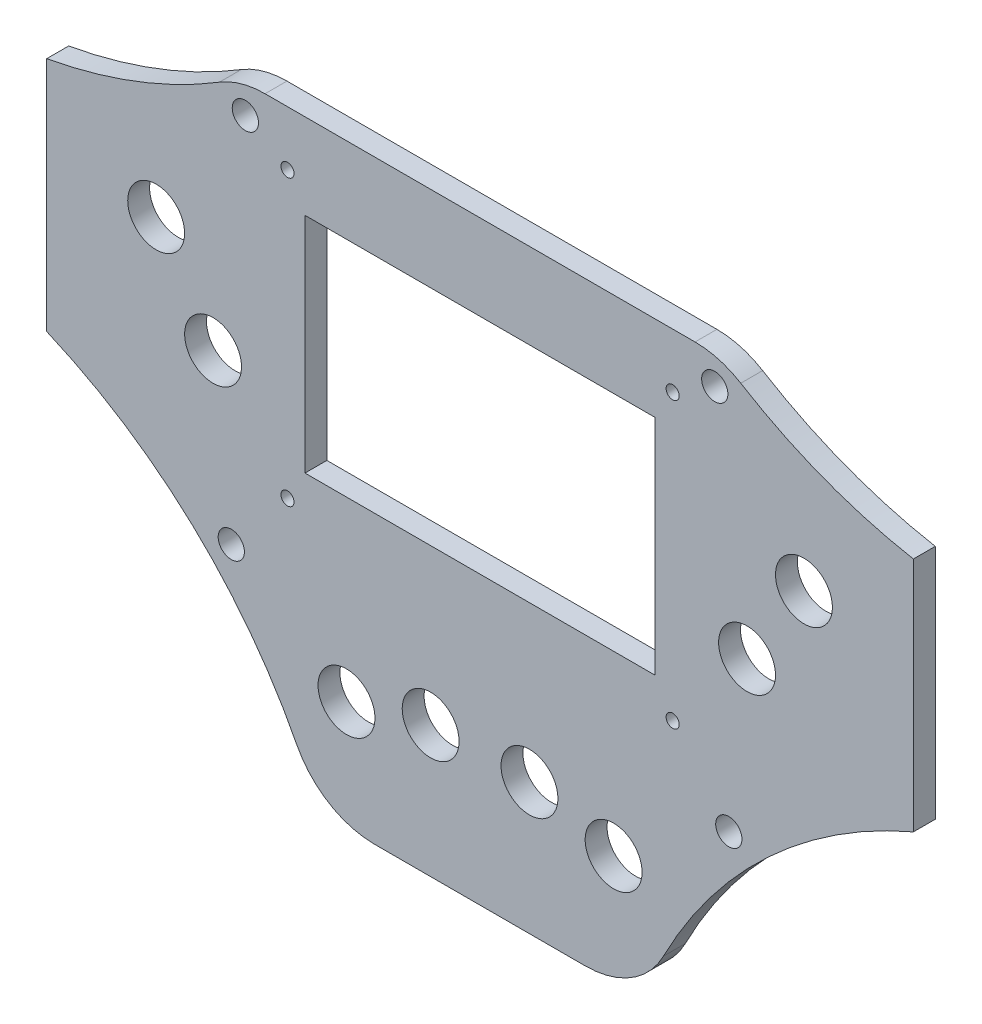
ISO-10303-21;
HEADER;
FILE_DESCRIPTION(('STEP AP214'),'2;1');
FILE_NAME('part.step','',(''),(''),'','','');
FILE_SCHEMA(('AUTOMOTIVE_DESIGN { 1 0 10303 214 1 1 1 1 }'));
ENDSEC;
DATA;
#1=APPLICATION_CONTEXT('core data for automotive mechanical design processes');
#2=APPLICATION_PROTOCOL_DEFINITION('international standard','automotive_design',2000,#1);
#3=PRODUCT_CONTEXT('',#1,'mechanical');
#4=PRODUCT('Part','Part','',(#3));
#5=PRODUCT_RELATED_PRODUCT_CATEGORY('part','',(#4));
#6=PRODUCT_DEFINITION_FORMATION('','',#4);
#7=PRODUCT_DEFINITION_CONTEXT('part definition',#1,'design');
#8=PRODUCT_DEFINITION('design','',#6,#7);
#9=PRODUCT_DEFINITION_SHAPE('','',#8);
#10=(LENGTH_UNIT() NAMED_UNIT(*) SI_UNIT(.MILLI.,.METRE.));
#11=(NAMED_UNIT(*) PLANE_ANGLE_UNIT() SI_UNIT($,.RADIAN.));
#12=(NAMED_UNIT(*) SI_UNIT($,.STERADIAN.) SOLID_ANGLE_UNIT());
#13=UNCERTAINTY_MEASURE_WITH_UNIT(LENGTH_MEASURE(1.E-05),#10,'distance_accuracy_value','');
#14=(GEOMETRIC_REPRESENTATION_CONTEXT(3) GLOBAL_UNCERTAINTY_ASSIGNED_CONTEXT((#13)) GLOBAL_UNIT_ASSIGNED_CONTEXT((#10,
#11,#12)) REPRESENTATION_CONTEXT('',''));
#15=CARTESIAN_POINT('',(0.,0.,0.));
#16=DIRECTION('',(0.,0.,1.));
#17=DIRECTION('',(1.,0.,0.));
#18=AXIS2_PLACEMENT_3D('',#15,#16,#17);
#19=CARTESIAN_POINT('',(119.602505223607,163.139457213261,5.));
#20=DIRECTION('',(0.,0.,-1.));
#21=DIRECTION('',(-1.,0.,0.));
#22=AXIS2_PLACEMENT_3D('',#19,#20,#21);
#23=PLANE('',#22);
#24=CARTESIAN_POINT('',(74.,31.1676261344596,5.));
#25=DIRECTION('',(0.,0.,1.));
#26=DIRECTION('',(1.,0.,0.));
#27=AXIS2_PLACEMENT_3D('',#24,#25,#26);
#28=CIRCLE('',#27,6.5);
#29=CARTESIAN_POINT('',(80.5,31.1676261344596,5.));
#30=VERTEX_POINT('',#29);
#31=EDGE_CURVE('E186',#30,#30,#28,.T.);
#32=ORIENTED_EDGE('',*,*,#31,.F.);
#33=EDGE_LOOP('',(#32));
#34=FACE_BOUND('',#33,.T.);
#35=CARTESIAN_POINT('',(119.602505223607,163.139457213261,5.));
#36=DIRECTION('',(0.,0.,-1.));
#37=DIRECTION('',(-1.,0.,0.));
#38=AXIS2_PLACEMENT_3D('',#35,#36,#37);
#39=CIRCLE('',#38,115.);
#40=CARTESIAN_POINT('',(99.,50.,5.));
#41=VERTEX_POINT('',#40);
#42=CARTESIAN_POINT('',(59.5611162901894,65.0576973649275,5.));
#43=VERTEX_POINT('',#42);
#44=EDGE_CURVE('E192',#41,#43,#39,.T.);
#45=ORIENTED_EDGE('',*,*,#44,.T.);
#46=CARTESIAN_POINT('',(49.1191356061168,48.,5.));
#47=DIRECTION('',(0.,0.,1.));
#48=DIRECTION('',(1.,0.,0.));
#49=AXIS2_PLACEMENT_3D('',#46,#47,#48);
#50=CIRCLE('',#49,20.);
#51=CARTESIAN_POINT('',(49.1191356061168,68.,5.));
#52=VERTEX_POINT('',#51);
#53=EDGE_CURVE('E195',#43,#52,#50,.T.);
#54=ORIENTED_EDGE('',*,*,#53,.T.);
#55=DIRECTION('',(-1.,0.,0.));
#56=VECTOR('',#55,1.);
#57=CARTESIAN_POINT('',(-49.1191356061168,68.,5.));
#58=LINE('',#57,#56);
#59=CARTESIAN_POINT('',(-49.1191356061168,68.,5.));
#60=VERTEX_POINT('',#59);
#61=EDGE_CURVE('E198',#52,#60,#58,.T.);
#62=ORIENTED_EDGE('',*,*,#61,.T.);
#63=CARTESIAN_POINT('',(-49.1191356061168,48.,5.));
#64=DIRECTION('',(0.,0.,1.));
#65=DIRECTION('',(-1.,0.,0.));
#66=AXIS2_PLACEMENT_3D('',#63,#64,#65);
#67=CIRCLE('',#66,20.);
#68=CARTESIAN_POINT('',(-59.5611162901894,65.0576973649275,5.));
#69=VERTEX_POINT('',#68);
#70=EDGE_CURVE('E200',#60,#69,#67,.T.);
#71=ORIENTED_EDGE('',*,*,#70,.T.);
#72=CARTESIAN_POINT('',(-119.602505223607,163.139457213261,5.));
#73=DIRECTION('',(0.,0.,-1.));
#74=DIRECTION('',(1.,0.,0.));
#75=AXIS2_PLACEMENT_3D('',#72,#73,#74);
#76=CIRCLE('',#75,115.);
#77=CARTESIAN_POINT('',(-99.,50.,5.));
#78=VERTEX_POINT('',#77);
#79=EDGE_CURVE('E202',#69,#78,#76,.T.);
#80=ORIENTED_EDGE('',*,*,#79,.T.);
#81=DIRECTION('',(0.,-1.,0.));
#82=VECTOR('',#81,1.);
#83=CARTESIAN_POINT('',(-99.,-3.99999999999998,5.));
#84=LINE('',#83,#82);
#85=CARTESIAN_POINT('',(-99.0000000000001,-4.,5.));
#86=VERTEX_POINT('',#85);
#87=EDGE_CURVE('E204',#78,#86,#84,.T.);
#88=ORIENTED_EDGE('',*,*,#87,.T.);
#89=CARTESIAN_POINT('',(-144.147014112087,-109.767419921084,5.));
#90=DIRECTION('',(0.,0.,-1.));
#91=DIRECTION('',(1.,0.,0.));
#92=AXIS2_PLACEMENT_3D('',#89,#90,#91);
#93=CIRCLE('',#92,115.);
#94=CARTESIAN_POINT('',(-41.8900641106708,-57.1507288771977,5.));
#95=VERTEX_POINT('',#94);
#96=EDGE_CURVE('E206',#86,#95,#93,.T.);
#97=ORIENTED_EDGE('',*,*,#96,.T.);
#98=CARTESIAN_POINT('',(-24.1062467191201,-48.,5.));
#99=DIRECTION('',(0.,0.,1.));
#100=DIRECTION('',(-1.,0.,0.));
#101=AXIS2_PLACEMENT_3D('',#98,#99,#100);
#102=CIRCLE('',#101,20.);
#103=CARTESIAN_POINT('',(-24.1062467191201,-68.,5.));
#104=VERTEX_POINT('',#103);
#105=EDGE_CURVE('E208',#95,#104,#102,.T.);
#106=ORIENTED_EDGE('',*,*,#105,.T.);
#107=DIRECTION('',(1.,0.,0.));
#108=VECTOR('',#107,1.);
#109=CARTESIAN_POINT('',(-24.1062467191201,-68.,5.));
#110=LINE('',#109,#108);
#111=CARTESIAN_POINT('',(24.1062467191201,-68.,5.));
#112=VERTEX_POINT('',#111);
#113=EDGE_CURVE('E210',#104,#112,#110,.T.);
#114=ORIENTED_EDGE('',*,*,#113,.T.);
#115=CARTESIAN_POINT('',(24.1062467191201,-48.,5.));
#116=DIRECTION('',(0.,0.,1.));
#117=DIRECTION('',(1.,0.,0.));
#118=AXIS2_PLACEMENT_3D('',#115,#116,#117);
#119=CIRCLE('',#118,20.);
#120=CARTESIAN_POINT('',(41.8900641106707,-57.1507288771977,5.));
#121=VERTEX_POINT('',#120);
#122=EDGE_CURVE('E212',#112,#121,#119,.T.);
#123=ORIENTED_EDGE('',*,*,#122,.T.);
#124=CARTESIAN_POINT('',(144.147014112087,-109.767419921084,5.));
#125=DIRECTION('',(0.,0.,-1.));
#126=DIRECTION('',(-1.,0.,0.));
#127=AXIS2_PLACEMENT_3D('',#124,#125,#126);
#128=CIRCLE('',#127,115.);
#129=CARTESIAN_POINT('',(99.,-3.99999999999998,5.));
#130=VERTEX_POINT('',#129);
#131=EDGE_CURVE('E214',#121,#130,#128,.T.);
#132=ORIENTED_EDGE('',*,*,#131,.T.);
#133=DIRECTION('',(0.,1.,0.));
#134=VECTOR('',#133,1.);
#135=CARTESIAN_POINT('',(99.,-3.99999999999998,5.));
#136=LINE('',#135,#134);
#137=EDGE_CURVE('E216',#130,#41,#136,.T.);
#138=ORIENTED_EDGE('',*,*,#137,.T.);
#139=EDGE_LOOP('',(#45,#54,#62,#71,#80,#88,#97,#106,#114,#123,#132,#138));
#140=FACE_BOUND('',#139,.T.);
#141=DIRECTION('',(0.,-1.,0.));
#142=VECTOR('',#141,1.);
#143=CARTESIAN_POINT('',(-40.,-2.49999999999999,5.));
#144=LINE('',#143,#142);
#145=CARTESIAN_POINT('',(-40.,48.5,5.));
#146=VERTEX_POINT('',#145);
#147=CARTESIAN_POINT('',(-40.,-2.49999999999999,5.));
#148=VERTEX_POINT('',#147);
#149=EDGE_CURVE('E147',#146,#148,#144,.T.);
#150=ORIENTED_EDGE('',*,*,#149,.F.);
#151=DIRECTION('',(-1.,0.,0.));
#152=VECTOR('',#151,1.);
#153=CARTESIAN_POINT('',(-40.,48.5,5.));
#154=LINE('',#153,#152);
#155=CARTESIAN_POINT('',(40.,48.5,5.));
#156=VERTEX_POINT('',#155);
#157=EDGE_CURVE('E170',#156,#146,#154,.T.);
#158=ORIENTED_EDGE('',*,*,#157,.F.);
#159=DIRECTION('',(0.,1.,0.));
#160=VECTOR('',#159,1.);
#161=CARTESIAN_POINT('',(40.,-2.49999999999999,5.));
#162=LINE('',#161,#160);
#163=CARTESIAN_POINT('',(40.,-2.49999999999999,5.));
#164=VERTEX_POINT('',#163);
#165=EDGE_CURVE('E168',#164,#156,#162,.T.);
#166=ORIENTED_EDGE('',*,*,#165,.F.);
#167=DIRECTION('',(1.,0.,0.));
#168=VECTOR('',#167,1.);
#169=CARTESIAN_POINT('',(-40.,-2.49999999999999,5.));
#170=LINE('',#169,#168);
#171=EDGE_CURVE('E155',#148,#164,#170,.T.);
#172=ORIENTED_EDGE('',*,*,#171,.F.);
#173=EDGE_LOOP('',(#150,#158,#166,#172));
#174=FACE_BOUND('',#173,.T.);
#175=CARTESIAN_POINT('',(11.289140567969,-38.,5.));
#176=DIRECTION('',(0.,0.,1.));
#177=DIRECTION('',(1.,0.,0.));
#178=AXIS2_PLACEMENT_3D('',#175,#176,#177);
#179=CIRCLE('',#178,6.5);
#180=CARTESIAN_POINT('',(17.7891405679689,-38.,5.));
#181=VERTEX_POINT('',#180);
#182=EDGE_CURVE('E176',#181,#181,#179,.T.);
#183=ORIENTED_EDGE('',*,*,#182,.F.);
#184=EDGE_LOOP('',(#183));
#185=FACE_BOUND('',#184,.T.);
#186=CARTESIAN_POINT('',(30.5141585693794,-43.,5.));
#187=DIRECTION('',(0.,0.,1.));
#188=DIRECTION('',(1.,0.,0.));
#189=AXIS2_PLACEMENT_3D('',#186,#187,#188);
#190=CIRCLE('',#189,6.5);
#191=CARTESIAN_POINT('',(37.0141585693794,-43.,5.));
#192=VERTEX_POINT('',#191);
#193=EDGE_CURVE('E724',#192,#192,#190,.T.);
#194=ORIENTED_EDGE('',*,*,#193,.F.);
#195=EDGE_LOOP('',(#194));
#196=FACE_BOUND('',#195,.T.);
#197=CARTESIAN_POINT('',(61.,11.2610411169396,5.));
#198=DIRECTION('',(0.,0.,1.));
#199=DIRECTION('',(1.,0.,0.));
#200=AXIS2_PLACEMENT_3D('',#197,#198,#199);
#201=CIRCLE('',#200,6.50000000000002);
#202=CARTESIAN_POINT('',(67.5,11.2610411169396,5.));
#203=VERTEX_POINT('',#202);
#204=EDGE_CURVE('E718',#203,#203,#201,.T.);
#205=ORIENTED_EDGE('',*,*,#204,.F.);
#206=EDGE_LOOP('',(#205));
#207=FACE_BOUND('',#206,.T.);
#208=CARTESIAN_POINT('',(-53.6243016500244,61.4463557748613,5.));
#209=DIRECTION('',(0.,0.,1.));
#210=DIRECTION('',(-1.,0.,0.));
#211=AXIS2_PLACEMENT_3D('',#208,#209,#210);
#212=CIRCLE('',#211,3.);
#213=CARTESIAN_POINT('',(-56.6243016500244,61.4463557748613,5.));
#214=VERTEX_POINT('',#213);
#215=EDGE_CURVE('E712',#214,#214,#212,.T.);
#216=ORIENTED_EDGE('',*,*,#215,.F.);
#217=EDGE_LOOP('',(#216));
#218=FACE_BOUND('',#217,.T.);
#219=CARTESIAN_POINT('',(-56.8349136115492,-25.0288417973948,5.));
#220=DIRECTION('',(0.,0.,1.));
#221=DIRECTION('',(-1.,0.,0.));
#222=AXIS2_PLACEMENT_3D('',#219,#220,#221);
#223=CIRCLE('',#222,3.);
#224=CARTESIAN_POINT('',(-59.8349136115492,-25.0288417973948,5.));
#225=VERTEX_POINT('',#224);
#226=EDGE_CURVE('E706',#225,#225,#223,.T.);
#227=ORIENTED_EDGE('',*,*,#226,.F.);
#228=EDGE_LOOP('',(#227));
#229=FACE_BOUND('',#228,.T.);
#230=CARTESIAN_POINT('',(56.8349136115492,-25.0288417973948,5.));
#231=DIRECTION('',(0.,0.,1.));
#232=DIRECTION('',(1.,0.,0.));
#233=AXIS2_PLACEMENT_3D('',#230,#231,#232);
#234=CIRCLE('',#233,3.);
#235=CARTESIAN_POINT('',(59.8349136115492,-25.0288417973948,5.));
#236=VERTEX_POINT('',#235);
#237=EDGE_CURVE('E700',#236,#236,#234,.T.);
#238=ORIENTED_EDGE('',*,*,#237,.F.);
#239=EDGE_LOOP('',(#238));
#240=FACE_BOUND('',#239,.T.);
#241=CARTESIAN_POINT('',(-44.,55.5,5.));
#242=DIRECTION('',(0.,0.,1.));
#243=DIRECTION('',(-1.,0.,0.));
#244=AXIS2_PLACEMENT_3D('',#241,#242,#243);
#245=CIRCLE('',#244,1.5);
#246=CARTESIAN_POINT('',(-45.5,55.5,5.));
#247=VERTEX_POINT('',#246);
#248=EDGE_CURVE('E694',#247,#247,#245,.T.);
#249=ORIENTED_EDGE('',*,*,#248,.F.);
#250=EDGE_LOOP('',(#249));
#251=FACE_BOUND('',#250,.T.);
#252=CARTESIAN_POINT('',(-44.,-9.49999999999997,5.));
#253=DIRECTION('',(0.,0.,1.));
#254=DIRECTION('',(-1.,0.,0.));
#255=AXIS2_PLACEMENT_3D('',#252,#253,#254);
#256=CIRCLE('',#255,1.5);
#257=CARTESIAN_POINT('',(-45.5,-9.49999999999997,5.));
#258=VERTEX_POINT('',#257);
#259=EDGE_CURVE('E688',#258,#258,#256,.T.);
#260=ORIENTED_EDGE('',*,*,#259,.F.);
#261=EDGE_LOOP('',(#260));
#262=FACE_BOUND('',#261,.T.);
#263=CARTESIAN_POINT('',(44.,-9.49999999999997,5.));
#264=DIRECTION('',(0.,0.,1.));
#265=DIRECTION('',(1.,0.,0.));
#266=AXIS2_PLACEMENT_3D('',#263,#264,#265);
#267=CIRCLE('',#266,1.5);
#268=CARTESIAN_POINT('',(45.5,-9.49999999999997,5.));
#269=VERTEX_POINT('',#268);
#270=EDGE_CURVE('E682',#269,#269,#267,.T.);
#271=ORIENTED_EDGE('',*,*,#270,.F.);
#272=EDGE_LOOP('',(#271));
#273=FACE_BOUND('',#272,.T.);
#274=CARTESIAN_POINT('',(44.,55.5,5.));
#275=DIRECTION('',(0.,0.,1.));
#276=DIRECTION('',(1.,0.,0.));
#277=AXIS2_PLACEMENT_3D('',#274,#275,#276);
#278=CIRCLE('',#277,1.5);
#279=CARTESIAN_POINT('',(45.5,55.5,5.));
#280=VERTEX_POINT('',#279);
#281=EDGE_CURVE('E676',#280,#280,#278,.T.);
#282=ORIENTED_EDGE('',*,*,#281,.F.);
#283=EDGE_LOOP('',(#282));
#284=FACE_BOUND('',#283,.T.);
#285=CARTESIAN_POINT('',(-30.5141585693794,-43.,5.));
#286=DIRECTION('',(0.,0.,1.));
#287=DIRECTION('',(-1.,0.,0.));
#288=AXIS2_PLACEMENT_3D('',#285,#286,#287);
#289=CIRCLE('',#288,6.5);
#290=CARTESIAN_POINT('',(-37.0141585693794,-43.,5.));
#291=VERTEX_POINT('',#290);
#292=EDGE_CURVE('E670',#291,#291,#289,.T.);
#293=ORIENTED_EDGE('',*,*,#292,.F.);
#294=EDGE_LOOP('',(#293));
#295=FACE_BOUND('',#294,.T.);
#296=CARTESIAN_POINT('',(-11.289140567969,-38.,5.));
#297=DIRECTION('',(0.,0.,1.));
#298=DIRECTION('',(-1.,0.,0.));
#299=AXIS2_PLACEMENT_3D('',#296,#297,#298);
#300=CIRCLE('',#299,6.5);
#301=CARTESIAN_POINT('',(-17.789140567969,-38.,5.));
#302=VERTEX_POINT('',#301);
#303=EDGE_CURVE('E664',#302,#302,#300,.T.);
#304=ORIENTED_EDGE('',*,*,#303,.F.);
#305=EDGE_LOOP('',(#304));
#306=FACE_BOUND('',#305,.T.);
#307=CARTESIAN_POINT('',(-61.,11.2610411169396,5.));
#308=DIRECTION('',(0.,0.,1.));
#309=DIRECTION('',(-1.,0.,0.));
#310=AXIS2_PLACEMENT_3D('',#307,#308,#309);
#311=CIRCLE('',#310,6.50000000000002);
#312=CARTESIAN_POINT('',(-67.5,11.2610411169396,5.));
#313=VERTEX_POINT('',#312);
#314=EDGE_CURVE('E658',#313,#313,#311,.T.);
#315=ORIENTED_EDGE('',*,*,#314,.F.);
#316=EDGE_LOOP('',(#315));
#317=FACE_BOUND('',#316,.T.);
#318=CARTESIAN_POINT('',(-74.,31.1676261344596,5.));
#319=DIRECTION('',(0.,0.,1.));
#320=DIRECTION('',(-1.,0.,0.));
#321=AXIS2_PLACEMENT_3D('',#318,#319,#320);
#322=CIRCLE('',#321,6.5);
#323=CARTESIAN_POINT('',(-80.5,31.1676261344596,5.));
#324=VERTEX_POINT('',#323);
#325=EDGE_CURVE('E652',#324,#324,#322,.T.);
#326=ORIENTED_EDGE('',*,*,#325,.F.);
#327=EDGE_LOOP('',(#326));
#328=FACE_BOUND('',#327,.T.);
#329=CARTESIAN_POINT('',(53.6243016500244,61.4463557748613,5.));
#330=DIRECTION('',(0.,0.,1.));
#331=DIRECTION('',(1.,0.,0.));
#332=AXIS2_PLACEMENT_3D('',#329,#330,#331);
#333=CIRCLE('',#332,3.);
#334=CARTESIAN_POINT('',(56.6243016500244,61.4463557748613,5.));
#335=VERTEX_POINT('',#334);
#336=EDGE_CURVE('E643',#335,#335,#333,.T.);
#337=ORIENTED_EDGE('',*,*,#336,.F.);
#338=EDGE_LOOP('',(#337));
#339=FACE_BOUND('',#338,.T.);
#340=ADVANCED_FACE('F34',(#34,#140,#174,#185,#196,#207,#218,#229,#240,#251,#262,#273,#284,#295,
#306,#317,#328,#339),#23,.F.);
#341=CARTESIAN_POINT('',(119.602505223607,163.139457213261,0.));
#342=DIRECTION('',(0.,0.,-1.));
#343=DIRECTION('',(-1.,0.,0.));
#344=AXIS2_PLACEMENT_3D('',#341,#342,#343);
#345=PLANE('',#344);
#346=CARTESIAN_POINT('',(-74.,31.1676261344596,0.));
#347=DIRECTION('',(0.,0.,1.));
#348=DIRECTION('',(-1.,0.,0.));
#349=AXIS2_PLACEMENT_3D('',#346,#347,#348);
#350=CIRCLE('',#349,6.5);
#351=CARTESIAN_POINT('',(-80.5,31.1676261344596,0.));
#352=VERTEX_POINT('',#351);
#353=EDGE_CURVE('E649',#352,#352,#350,.T.);
#354=ORIENTED_EDGE('',*,*,#353,.T.);
#355=EDGE_LOOP('',(#354));
#356=FACE_BOUND('',#355,.T.);
#357=CARTESIAN_POINT('',(-11.289140567969,-38.,0.));
#358=DIRECTION('',(0.,0.,1.));
#359=DIRECTION('',(-1.,0.,0.));
#360=AXIS2_PLACEMENT_3D('',#357,#358,#359);
#361=CIRCLE('',#360,6.5);
#362=CARTESIAN_POINT('',(-17.789140567969,-38.,0.));
#363=VERTEX_POINT('',#362);
#364=EDGE_CURVE('E661',#363,#363,#361,.T.);
#365=ORIENTED_EDGE('',*,*,#364,.T.);
#366=EDGE_LOOP('',(#365));
#367=FACE_BOUND('',#366,.T.);
#368=CARTESIAN_POINT('',(44.,55.5,0.));
#369=DIRECTION('',(0.,0.,1.));
#370=DIRECTION('',(1.,0.,0.));
#371=AXIS2_PLACEMENT_3D('',#368,#369,#370);
#372=CIRCLE('',#371,1.5);
#373=CARTESIAN_POINT('',(45.5,55.5,0.));
#374=VERTEX_POINT('',#373);
#375=EDGE_CURVE('E673',#374,#374,#372,.T.);
#376=ORIENTED_EDGE('',*,*,#375,.T.);
#377=EDGE_LOOP('',(#376));
#378=FACE_BOUND('',#377,.T.);
#379=CARTESIAN_POINT('',(-44.,-9.49999999999997,0.));
#380=DIRECTION('',(0.,0.,1.));
#381=DIRECTION('',(-1.,0.,0.));
#382=AXIS2_PLACEMENT_3D('',#379,#380,#381);
#383=CIRCLE('',#382,1.5);
#384=CARTESIAN_POINT('',(-45.5,-9.49999999999997,0.));
#385=VERTEX_POINT('',#384);
#386=EDGE_CURVE('E685',#385,#385,#383,.T.);
#387=ORIENTED_EDGE('',*,*,#386,.T.);
#388=EDGE_LOOP('',(#387));
#389=FACE_BOUND('',#388,.T.);
#390=CARTESIAN_POINT('',(56.8349136115492,-25.0288417973948,0.));
#391=DIRECTION('',(0.,0.,1.));
#392=DIRECTION('',(1.,0.,0.));
#393=AXIS2_PLACEMENT_3D('',#390,#391,#392);
#394=CIRCLE('',#393,3.);
#395=CARTESIAN_POINT('',(59.8349136115492,-25.0288417973948,0.));
#396=VERTEX_POINT('',#395);
#397=EDGE_CURVE('E697',#396,#396,#394,.T.);
#398=ORIENTED_EDGE('',*,*,#397,.T.);
#399=EDGE_LOOP('',(#398));
#400=FACE_BOUND('',#399,.T.);
#401=CARTESIAN_POINT('',(-53.6243016500244,61.4463557748613,0.));
#402=DIRECTION('',(0.,0.,1.));
#403=DIRECTION('',(-1.,0.,0.));
#404=AXIS2_PLACEMENT_3D('',#401,#402,#403);
#405=CIRCLE('',#404,3.);
#406=CARTESIAN_POINT('',(-56.6243016500244,61.4463557748613,0.));
#407=VERTEX_POINT('',#406);
#408=EDGE_CURVE('E709',#407,#407,#405,.T.);
#409=ORIENTED_EDGE('',*,*,#408,.T.);
#410=EDGE_LOOP('',(#409));
#411=FACE_BOUND('',#410,.T.);
#412=CARTESIAN_POINT('',(30.5141585693794,-43.,0.));
#413=DIRECTION('',(0.,0.,1.));
#414=DIRECTION('',(1.,0.,0.));
#415=AXIS2_PLACEMENT_3D('',#412,#413,#414);
#416=CIRCLE('',#415,6.5);
#417=CARTESIAN_POINT('',(37.0141585693794,-43.,0.));
#418=VERTEX_POINT('',#417);
#419=EDGE_CURVE('E721',#418,#418,#416,.T.);
#420=ORIENTED_EDGE('',*,*,#419,.T.);
#421=EDGE_LOOP('',(#420));
#422=FACE_BOUND('',#421,.T.);
#423=DIRECTION('',(-1.,0.,0.));
#424=VECTOR('',#423,1.);
#425=CARTESIAN_POINT('',(-40.,48.5,0.));
#426=LINE('',#425,#424);
#427=CARTESIAN_POINT('',(40.,48.5,0.));
#428=VERTEX_POINT('',#427);
#429=CARTESIAN_POINT('',(-40.,48.5,0.));
#430=VERTEX_POINT('',#429);
#431=EDGE_CURVE('E156',#428,#430,#426,.T.);
#432=ORIENTED_EDGE('',*,*,#431,.T.);
#433=DIRECTION('',(0.,-1.,0.));
#434=VECTOR('',#433,1.);
#435=CARTESIAN_POINT('',(-40.,-2.49999999999999,0.));
#436=LINE('',#435,#434);
#437=CARTESIAN_POINT('',(-40.,-2.49999999999999,0.));
#438=VERTEX_POINT('',#437);
#439=EDGE_CURVE('E57',#430,#438,#436,.T.);
#440=ORIENTED_EDGE('',*,*,#439,.T.);
#441=DIRECTION('',(1.,0.,0.));
#442=VECTOR('',#441,1.);
#443=CARTESIAN_POINT('',(-40.,-2.49999999999999,0.));
#444=LINE('',#443,#442);
#445=CARTESIAN_POINT('',(40.,-2.49999999999999,0.));
#446=VERTEX_POINT('',#445);
#447=EDGE_CURVE('E162',#438,#446,#444,.T.);
#448=ORIENTED_EDGE('',*,*,#447,.T.);
#449=DIRECTION('',(0.,1.,0.));
#450=VECTOR('',#449,1.);
#451=CARTESIAN_POINT('',(40.,-2.49999999999999,0.));
#452=LINE('',#451,#450);
#453=EDGE_CURVE('E178',#446,#428,#452,.T.);
#454=ORIENTED_EDGE('',*,*,#453,.T.);
#455=EDGE_LOOP('',(#432,#440,#448,#454));
#456=FACE_BOUND('',#455,.T.);
#457=CARTESIAN_POINT('',(74.,31.1676261344596,0.));
#458=DIRECTION('',(0.,0.,1.));
#459=DIRECTION('',(1.,0.,0.));
#460=AXIS2_PLACEMENT_3D('',#457,#458,#459);
#461=CIRCLE('',#460,6.5);
#462=CARTESIAN_POINT('',(80.5,31.1676261344596,0.));
#463=VERTEX_POINT('',#462);
#464=EDGE_CURVE('E163',#463,#463,#461,.T.);
#465=ORIENTED_EDGE('',*,*,#464,.T.);
#466=EDGE_LOOP('',(#465));
#467=FACE_BOUND('',#466,.T.);
#468=CARTESIAN_POINT('',(119.602505223607,163.139457213261,0.));
#469=DIRECTION('',(0.,0.,-1.));
#470=DIRECTION('',(-1.,0.,0.));
#471=AXIS2_PLACEMENT_3D('',#468,#469,#470);
#472=CIRCLE('',#471,115.);
#473=CARTESIAN_POINT('',(99.,50.,0.));
#474=VERTEX_POINT('',#473);
#475=CARTESIAN_POINT('',(59.5611162901894,65.0576973649275,0.));
#476=VERTEX_POINT('',#475);
#477=EDGE_CURVE('E189',#474,#476,#472,.T.);
#478=ORIENTED_EDGE('',*,*,#477,.F.);
#479=DIRECTION('',(0.,1.,0.));
#480=VECTOR('',#479,1.);
#481=CARTESIAN_POINT('',(99.,-3.99999999999998,0.));
#482=LINE('',#481,#480);
#483=CARTESIAN_POINT('',(99.,-3.99999999999998,0.));
#484=VERTEX_POINT('',#483);
#485=EDGE_CURVE('E196',#484,#474,#482,.T.);
#486=ORIENTED_EDGE('',*,*,#485,.F.);
#487=CARTESIAN_POINT('',(144.147014112087,-109.767419921084,0.));
#488=DIRECTION('',(0.,0.,-1.));
#489=DIRECTION('',(-1.,0.,0.));
#490=AXIS2_PLACEMENT_3D('',#487,#488,#489);
#491=CIRCLE('',#490,115.);
#492=CARTESIAN_POINT('',(41.8900641106707,-57.1507288771977,0.));
#493=VERTEX_POINT('',#492);
#494=EDGE_CURVE('E239',#493,#484,#491,.T.);
#495=ORIENTED_EDGE('',*,*,#494,.F.);
#496=CARTESIAN_POINT('',(24.1062467191201,-48.,0.));
#497=DIRECTION('',(0.,0.,1.));
#498=DIRECTION('',(1.,0.,0.));
#499=AXIS2_PLACEMENT_3D('',#496,#497,#498);
#500=CIRCLE('',#499,20.);
#501=CARTESIAN_POINT('',(24.1062467191201,-68.,0.));
#502=VERTEX_POINT('',#501);
#503=EDGE_CURVE('E237',#502,#493,#500,.T.);
#504=ORIENTED_EDGE('',*,*,#503,.F.);
#505=DIRECTION('',(1.,0.,0.));
#506=VECTOR('',#505,1.);
#507=CARTESIAN_POINT('',(-24.1062467191201,-68.,0.));
#508=LINE('',#507,#506);
#509=CARTESIAN_POINT('',(-24.1062467191201,-68.,0.));
#510=VERTEX_POINT('',#509);
#511=EDGE_CURVE('E235',#510,#502,#508,.T.);
#512=ORIENTED_EDGE('',*,*,#511,.F.);
#513=CARTESIAN_POINT('',(-24.1062467191201,-48.,0.));
#514=DIRECTION('',(0.,0.,1.));
#515=DIRECTION('',(-1.,0.,0.));
#516=AXIS2_PLACEMENT_3D('',#513,#514,#515);
#517=CIRCLE('',#516,20.);
#518=CARTESIAN_POINT('',(-41.8900641106708,-57.1507288771977,0.));
#519=VERTEX_POINT('',#518);
#520=EDGE_CURVE('E233',#519,#510,#517,.T.);
#521=ORIENTED_EDGE('',*,*,#520,.F.);
#522=CARTESIAN_POINT('',(-144.147014112087,-109.767419921084,0.));
#523=DIRECTION('',(0.,0.,-1.));
#524=DIRECTION('',(1.,0.,0.));
#525=AXIS2_PLACEMENT_3D('',#522,#523,#524);
#526=CIRCLE('',#525,115.);
#527=CARTESIAN_POINT('',(-99.0000000000001,-4.,0.));
#528=VERTEX_POINT('',#527);
#529=EDGE_CURVE('E231',#528,#519,#526,.T.);
#530=ORIENTED_EDGE('',*,*,#529,.F.);
#531=DIRECTION('',(0.,-1.,0.));
#532=VECTOR('',#531,1.);
#533=CARTESIAN_POINT('',(-99.,-3.99999999999998,0.));
#534=LINE('',#533,#532);
#535=CARTESIAN_POINT('',(-99.,50.,0.));
#536=VERTEX_POINT('',#535);
#537=EDGE_CURVE('E229',#536,#528,#534,.T.);
#538=ORIENTED_EDGE('',*,*,#537,.F.);
#539=CARTESIAN_POINT('',(-119.602505223607,163.139457213261,0.));
#540=DIRECTION('',(0.,0.,-1.));
#541=DIRECTION('',(1.,0.,0.));
#542=AXIS2_PLACEMENT_3D('',#539,#540,#541);
#543=CIRCLE('',#542,115.);
#544=CARTESIAN_POINT('',(-59.5611162901894,65.0576973649275,0.));
#545=VERTEX_POINT('',#544);
#546=EDGE_CURVE('E227',#545,#536,#543,.T.);
#547=ORIENTED_EDGE('',*,*,#546,.F.);
#548=CARTESIAN_POINT('',(-49.1191356061168,48.,0.));
#549=DIRECTION('',(0.,0.,1.));
#550=DIRECTION('',(-1.,0.,0.));
#551=AXIS2_PLACEMENT_3D('',#548,#549,#550);
#552=CIRCLE('',#551,20.);
#553=CARTESIAN_POINT('',(-49.1191356061168,68.,0.));
#554=VERTEX_POINT('',#553);
#555=EDGE_CURVE('E225',#554,#545,#552,.T.);
#556=ORIENTED_EDGE('',*,*,#555,.F.);
#557=DIRECTION('',(-1.,0.,0.));
#558=VECTOR('',#557,1.);
#559=CARTESIAN_POINT('',(-49.1191356061168,68.,0.));
#560=LINE('',#559,#558);
#561=CARTESIAN_POINT('',(49.1191356061168,68.,0.));
#562=VERTEX_POINT('',#561);
#563=EDGE_CURVE('E223',#562,#554,#560,.T.);
#564=ORIENTED_EDGE('',*,*,#563,.F.);
#565=CARTESIAN_POINT('',(49.1191356061168,48.,0.));
#566=DIRECTION('',(0.,0.,1.));
#567=DIRECTION('',(1.,0.,0.));
#568=AXIS2_PLACEMENT_3D('',#565,#566,#567);
#569=CIRCLE('',#568,20.);
#570=EDGE_CURVE('E221',#476,#562,#569,.T.);
#571=ORIENTED_EDGE('',*,*,#570,.F.);
#572=EDGE_LOOP('',(#478,#486,#495,#504,#512,#521,#530,#538,#547,#556,#564,#571));
#573=FACE_BOUND('',#572,.T.);
#574=CARTESIAN_POINT('',(11.289140567969,-38.,0.));
#575=DIRECTION('',(0.,0.,1.));
#576=DIRECTION('',(1.,0.,0.));
#577=AXIS2_PLACEMENT_3D('',#574,#575,#576);
#578=CIRCLE('',#577,6.5);
#579=CARTESIAN_POINT('',(17.7891405679689,-38.,0.));
#580=VERTEX_POINT('',#579);
#581=EDGE_CURVE('E727',#580,#580,#578,.T.);
#582=ORIENTED_EDGE('',*,*,#581,.T.);
#583=EDGE_LOOP('',(#582));
#584=FACE_BOUND('',#583,.T.);
#585=CARTESIAN_POINT('',(61.,11.2610411169396,0.));
#586=DIRECTION('',(0.,0.,1.));
#587=DIRECTION('',(1.,0.,0.));
#588=AXIS2_PLACEMENT_3D('',#585,#586,#587);
#589=CIRCLE('',#588,6.50000000000002);
#590=CARTESIAN_POINT('',(67.5,11.2610411169396,0.));
#591=VERTEX_POINT('',#590);
#592=EDGE_CURVE('E715',#591,#591,#589,.T.);
#593=ORIENTED_EDGE('',*,*,#592,.T.);
#594=EDGE_LOOP('',(#593));
#595=FACE_BOUND('',#594,.T.);
#596=CARTESIAN_POINT('',(-56.8349136115492,-25.0288417973948,0.));
#597=DIRECTION('',(0.,0.,1.));
#598=DIRECTION('',(-1.,0.,0.));
#599=AXIS2_PLACEMENT_3D('',#596,#597,#598);
#600=CIRCLE('',#599,3.);
#601=CARTESIAN_POINT('',(-59.8349136115492,-25.0288417973948,0.));
#602=VERTEX_POINT('',#601);
#603=EDGE_CURVE('E703',#602,#602,#600,.T.);
#604=ORIENTED_EDGE('',*,*,#603,.T.);
#605=EDGE_LOOP('',(#604));
#606=FACE_BOUND('',#605,.T.);
#607=CARTESIAN_POINT('',(-44.,55.5,0.));
#608=DIRECTION('',(0.,0.,1.));
#609=DIRECTION('',(-1.,0.,0.));
#610=AXIS2_PLACEMENT_3D('',#607,#608,#609);
#611=CIRCLE('',#610,1.5);
#612=CARTESIAN_POINT('',(-45.5,55.5,0.));
#613=VERTEX_POINT('',#612);
#614=EDGE_CURVE('E691',#613,#613,#611,.T.);
#615=ORIENTED_EDGE('',*,*,#614,.T.);
#616=EDGE_LOOP('',(#615));
#617=FACE_BOUND('',#616,.T.);
#618=CARTESIAN_POINT('',(44.,-9.49999999999997,0.));
#619=DIRECTION('',(0.,0.,1.));
#620=DIRECTION('',(1.,0.,0.));
#621=AXIS2_PLACEMENT_3D('',#618,#619,#620);
#622=CIRCLE('',#621,1.5);
#623=CARTESIAN_POINT('',(45.5,-9.49999999999997,0.));
#624=VERTEX_POINT('',#623);
#625=EDGE_CURVE('E679',#624,#624,#622,.T.);
#626=ORIENTED_EDGE('',*,*,#625,.T.);
#627=EDGE_LOOP('',(#626));
#628=FACE_BOUND('',#627,.T.);
#629=CARTESIAN_POINT('',(-30.5141585693794,-43.,0.));
#630=DIRECTION('',(0.,0.,1.));
#631=DIRECTION('',(-1.,0.,0.));
#632=AXIS2_PLACEMENT_3D('',#629,#630,#631);
#633=CIRCLE('',#632,6.5);
#634=CARTESIAN_POINT('',(-37.0141585693794,-43.,0.));
#635=VERTEX_POINT('',#634);
#636=EDGE_CURVE('E667',#635,#635,#633,.T.);
#637=ORIENTED_EDGE('',*,*,#636,.T.);
#638=EDGE_LOOP('',(#637));
#639=FACE_BOUND('',#638,.T.);
#640=CARTESIAN_POINT('',(-61.,11.2610411169396,0.));
#641=DIRECTION('',(0.,0.,1.));
#642=DIRECTION('',(-1.,0.,0.));
#643=AXIS2_PLACEMENT_3D('',#640,#641,#642);
#644=CIRCLE('',#643,6.50000000000002);
#645=CARTESIAN_POINT('',(-67.5,11.2610411169396,0.));
#646=VERTEX_POINT('',#645);
#647=EDGE_CURVE('E655',#646,#646,#644,.T.);
#648=ORIENTED_EDGE('',*,*,#647,.T.);
#649=EDGE_LOOP('',(#648));
#650=FACE_BOUND('',#649,.T.);
#651=CARTESIAN_POINT('',(53.6243016500244,61.4463557748613,0.));
#652=DIRECTION('',(0.,0.,1.));
#653=DIRECTION('',(1.,0.,0.));
#654=AXIS2_PLACEMENT_3D('',#651,#652,#653);
#655=CIRCLE('',#654,3.);
#656=CARTESIAN_POINT('',(56.6243016500244,61.4463557748613,0.));
#657=VERTEX_POINT('',#656);
#658=EDGE_CURVE('E646',#657,#657,#655,.T.);
#659=ORIENTED_EDGE('',*,*,#658,.T.);
#660=EDGE_LOOP('',(#659));
#661=FACE_BOUND('',#660,.T.);
#662=ADVANCED_FACE('F281',(#356,#367,#378,#389,#400,#411,#422,#456,#467,#573,#584,#595,#606,
#617,#628,#639,#650,#661),#345,.T.);
#663=CARTESIAN_POINT('',(119.602505223607,163.139457213261,5.));
#664=DIRECTION('',(0.,0.,-1.));
#665=DIRECTION('',(-1.,0.,0.));
#666=AXIS2_PLACEMENT_3D('',#663,#664,#665);
#667=CYLINDRICAL_SURFACE('',#666,115.);
#668=ORIENTED_EDGE('',*,*,#477,.T.);
#669=DIRECTION('',(0.,0.,-1.));
#670=VECTOR('',#669,1.);
#671=CARTESIAN_POINT('',(59.5611162901894,65.0576973649275,5.));
#672=LINE('',#671,#670);
#673=EDGE_CURVE('E11',#43,#476,#672,.T.);
#674=ORIENTED_EDGE('',*,*,#673,.F.);
#675=ORIENTED_EDGE('',*,*,#44,.F.);
#676=DIRECTION('',(0.,0.,-1.));
#677=VECTOR('',#676,1.);
#678=CARTESIAN_POINT('',(99.,50.,5.));
#679=LINE('',#678,#677);
#680=EDGE_CURVE('E218',#41,#474,#679,.T.);
#681=ORIENTED_EDGE('',*,*,#680,.T.);
#682=EDGE_LOOP('',(#668,#674,#675,#681));
#683=FACE_BOUND('',#682,.T.);
#684=ADVANCED_FACE('F36',(#683),#667,.F.);
#685=CARTESIAN_POINT('',(49.1191356061168,48.,5.));
#686=DIRECTION('',(0.,0.,-1.));
#687=DIRECTION('',(-1.,0.,0.));
#688=AXIS2_PLACEMENT_3D('',#685,#686,#687);
#689=CYLINDRICAL_SURFACE('',#688,20.);
#690=ORIENTED_EDGE('',*,*,#570,.T.);
#691=DIRECTION('',(0.,0.,-1.));
#692=VECTOR('',#691,1.);
#693=CARTESIAN_POINT('',(49.1191356061168,68.,5.));
#694=LINE('',#693,#692);
#695=EDGE_CURVE('E42',#52,#562,#694,.T.);
#696=ORIENTED_EDGE('',*,*,#695,.F.);
#697=ORIENTED_EDGE('',*,*,#53,.F.);
#698=ORIENTED_EDGE('',*,*,#673,.T.);
#699=EDGE_LOOP('',(#690,#696,#697,#698));
#700=FACE_BOUND('',#699,.T.);
#701=ADVANCED_FACE('F298',(#700),#689,.T.);
#702=CARTESIAN_POINT('',(-49.1191356061168,68.,5.));
#703=DIRECTION('',(0.,-1.,0.));
#704=DIRECTION('',(0.,0.,-1.));
#705=AXIS2_PLACEMENT_3D('',#702,#703,#704);
#706=PLANE('',#705);
#707=ORIENTED_EDGE('',*,*,#563,.T.);
#708=DIRECTION('',(0.,0.,-1.));
#709=VECTOR('',#708,1.);
#710=CARTESIAN_POINT('',(-49.1191356061168,68.,5.));
#711=LINE('',#710,#709);
#712=EDGE_CURVE('E268',#60,#554,#711,.T.);
#713=ORIENTED_EDGE('',*,*,#712,.F.);
#714=ORIENTED_EDGE('',*,*,#61,.F.);
#715=ORIENTED_EDGE('',*,*,#695,.T.);
#716=EDGE_LOOP('',(#707,#713,#714,#715));
#717=FACE_BOUND('',#716,.T.);
#718=ADVANCED_FACE('F275',(#717),#706,.F.);
#719=CARTESIAN_POINT('',(-49.1191356061168,48.,5.));
#720=DIRECTION('',(0.,0.,-1.));
#721=DIRECTION('',(-1.,0.,0.));
#722=AXIS2_PLACEMENT_3D('',#719,#720,#721);
#723=CYLINDRICAL_SURFACE('',#722,20.);
#724=ORIENTED_EDGE('',*,*,#555,.T.);
#725=DIRECTION('',(0.,0.,-1.));
#726=VECTOR('',#725,1.);
#727=CARTESIAN_POINT('',(-59.5611162901894,65.0576973649275,5.));
#728=LINE('',#727,#726);
#729=EDGE_CURVE('E265',#69,#545,#728,.T.);
#730=ORIENTED_EDGE('',*,*,#729,.F.);
#731=ORIENTED_EDGE('',*,*,#70,.F.);
#732=ORIENTED_EDGE('',*,*,#712,.T.);
#733=EDGE_LOOP('',(#724,#730,#731,#732));
#734=FACE_BOUND('',#733,.T.);
#735=ADVANCED_FACE('F287',(#734),#723,.T.);
#736=CARTESIAN_POINT('',(-119.602505223607,163.139457213261,5.));
#737=DIRECTION('',(0.,0.,-1.));
#738=DIRECTION('',(-1.,0.,0.));
#739=AXIS2_PLACEMENT_3D('',#736,#737,#738);
#740=CYLINDRICAL_SURFACE('',#739,115.);
#741=ORIENTED_EDGE('',*,*,#546,.T.);
#742=DIRECTION('',(0.,0.,-1.));
#743=VECTOR('',#742,1.);
#744=CARTESIAN_POINT('',(-99.,50.,5.));
#745=LINE('',#744,#743);
#746=EDGE_CURVE('E262',#78,#536,#745,.T.);
#747=ORIENTED_EDGE('',*,*,#746,.F.);
#748=ORIENTED_EDGE('',*,*,#79,.F.);
#749=ORIENTED_EDGE('',*,*,#729,.T.);
#750=EDGE_LOOP('',(#741,#747,#748,#749));
#751=FACE_BOUND('',#750,.T.);
#752=ADVANCED_FACE('F291',(#751),#740,.F.);
#753=CARTESIAN_POINT('',(-99.,-3.99999999999998,5.));
#754=DIRECTION('',(1.,0.,0.));
#755=DIRECTION('',(0.,0.,-1.));
#756=AXIS2_PLACEMENT_3D('',#753,#754,#755);
#757=PLANE('',#756);
#758=ORIENTED_EDGE('',*,*,#537,.T.);
#759=DIRECTION('',(0.,0.,-1.));
#760=VECTOR('',#759,1.);
#761=CARTESIAN_POINT('',(-99.0000000000001,-4.,5.));
#762=LINE('',#761,#760);
#763=EDGE_CURVE('E259',#86,#528,#762,.T.);
#764=ORIENTED_EDGE('',*,*,#763,.F.);
#765=ORIENTED_EDGE('',*,*,#87,.F.);
#766=ORIENTED_EDGE('',*,*,#746,.T.);
#767=EDGE_LOOP('',(#758,#764,#765,#766));
#768=FACE_BOUND('',#767,.T.);
#769=ADVANCED_FACE('F331',(#768),#757,.F.);
#770=CARTESIAN_POINT('',(-144.147014112087,-109.767419921084,5.));
#771=DIRECTION('',(0.,0.,-1.));
#772=DIRECTION('',(-1.,0.,0.));
#773=AXIS2_PLACEMENT_3D('',#770,#771,#772);
#774=CYLINDRICAL_SURFACE('',#773,115.);
#775=ORIENTED_EDGE('',*,*,#529,.T.);
#776=DIRECTION('',(0.,0.,-1.));
#777=VECTOR('',#776,1.);
#778=CARTESIAN_POINT('',(-41.8900641106708,-57.1507288771977,5.));
#779=LINE('',#778,#777);
#780=EDGE_CURVE('E256',#95,#519,#779,.T.);
#781=ORIENTED_EDGE('',*,*,#780,.F.);
#782=ORIENTED_EDGE('',*,*,#96,.F.);
#783=ORIENTED_EDGE('',*,*,#763,.T.);
#784=EDGE_LOOP('',(#775,#781,#782,#783));
#785=FACE_BOUND('',#784,.T.);
#786=ADVANCED_FACE('F329',(#785),#774,.F.);
#787=CARTESIAN_POINT('',(-24.1062467191201,-48.,5.));
#788=DIRECTION('',(0.,0.,-1.));
#789=DIRECTION('',(-1.,0.,0.));
#790=AXIS2_PLACEMENT_3D('',#787,#788,#789);
#791=CYLINDRICAL_SURFACE('',#790,20.);
#792=ORIENTED_EDGE('',*,*,#520,.T.);
#793=DIRECTION('',(0.,0.,-1.));
#794=VECTOR('',#793,1.);
#795=CARTESIAN_POINT('',(-24.1062467191201,-68.,5.));
#796=LINE('',#795,#794);
#797=EDGE_CURVE('E253',#104,#510,#796,.T.);
#798=ORIENTED_EDGE('',*,*,#797,.F.);
#799=ORIENTED_EDGE('',*,*,#105,.F.);
#800=ORIENTED_EDGE('',*,*,#780,.T.);
#801=EDGE_LOOP('',(#792,#798,#799,#800));
#802=FACE_BOUND('',#801,.T.);
#803=ADVANCED_FACE('F325',(#802),#791,.T.);
#804=CARTESIAN_POINT('',(-24.1062467191201,-68.,5.));
#805=DIRECTION('',(0.,1.,0.));
#806=DIRECTION('',(0.,0.,1.));
#807=AXIS2_PLACEMENT_3D('',#804,#805,#806);
#808=PLANE('',#807);
#809=ORIENTED_EDGE('',*,*,#511,.T.);
#810=DIRECTION('',(0.,0.,-1.));
#811=VECTOR('',#810,1.);
#812=CARTESIAN_POINT('',(24.1062467191201,-68.,5.));
#813=LINE('',#812,#811);
#814=EDGE_CURVE('E250',#112,#502,#813,.T.);
#815=ORIENTED_EDGE('',*,*,#814,.F.);
#816=ORIENTED_EDGE('',*,*,#113,.F.);
#817=ORIENTED_EDGE('',*,*,#797,.T.);
#818=EDGE_LOOP('',(#809,#815,#816,#817));
#819=FACE_BOUND('',#818,.T.);
#820=ADVANCED_FACE('F320',(#819),#808,.F.);
#821=CARTESIAN_POINT('',(24.1062467191201,-48.,5.));
#822=DIRECTION('',(0.,0.,-1.));
#823=DIRECTION('',(-1.,0.,0.));
#824=AXIS2_PLACEMENT_3D('',#821,#822,#823);
#825=CYLINDRICAL_SURFACE('',#824,20.);
#826=ORIENTED_EDGE('',*,*,#503,.T.);
#827=DIRECTION('',(0.,0.,-1.));
#828=VECTOR('',#827,1.);
#829=CARTESIAN_POINT('',(41.8900641106707,-57.1507288771977,5.));
#830=LINE('',#829,#828);
#831=EDGE_CURVE('E247',#121,#493,#830,.T.);
#832=ORIENTED_EDGE('',*,*,#831,.F.);
#833=ORIENTED_EDGE('',*,*,#122,.F.);
#834=ORIENTED_EDGE('',*,*,#814,.T.);
#835=EDGE_LOOP('',(#826,#832,#833,#834));
#836=FACE_BOUND('',#835,.T.);
#837=ADVANCED_FACE('F314',(#836),#825,.T.);
#838=CARTESIAN_POINT('',(144.147014112087,-109.767419921084,5.));
#839=DIRECTION('',(0.,0.,-1.));
#840=DIRECTION('',(-1.,0.,0.));
#841=AXIS2_PLACEMENT_3D('',#838,#839,#840);
#842=CYLINDRICAL_SURFACE('',#841,115.);
#843=ORIENTED_EDGE('',*,*,#494,.T.);
#844=DIRECTION('',(0.,0.,-1.));
#845=VECTOR('',#844,1.);
#846=CARTESIAN_POINT('',(99.,-3.99999999999998,5.));
#847=LINE('',#846,#845);
#848=EDGE_CURVE('E244',#130,#484,#847,.T.);
#849=ORIENTED_EDGE('',*,*,#848,.F.);
#850=ORIENTED_EDGE('',*,*,#131,.F.);
#851=ORIENTED_EDGE('',*,*,#831,.T.);
#852=EDGE_LOOP('',(#843,#849,#850,#851));
#853=FACE_BOUND('',#852,.T.);
#854=ADVANCED_FACE('F310',(#853),#842,.F.);
#855=CARTESIAN_POINT('',(99.,-3.99999999999998,5.));
#856=DIRECTION('',(-1.,0.,0.));
#857=DIRECTION('',(0.,0.,1.));
#858=AXIS2_PLACEMENT_3D('',#855,#856,#857);
#859=PLANE('',#858);
#860=ORIENTED_EDGE('',*,*,#485,.T.);
#861=ORIENTED_EDGE('',*,*,#680,.F.);
#862=ORIENTED_EDGE('',*,*,#137,.F.);
#863=ORIENTED_EDGE('',*,*,#848,.T.);
#864=EDGE_LOOP('',(#860,#861,#862,#863));
#865=FACE_BOUND('',#864,.T.);
#866=ADVANCED_FACE('F305',(#865),#859,.F.);
#867=CARTESIAN_POINT('',(74.,31.1676261344596,5.));
#868=DIRECTION('',(0.,0.,-1.));
#869=DIRECTION('',(-1.,0.,0.));
#870=AXIS2_PLACEMENT_3D('',#867,#868,#869);
#871=CYLINDRICAL_SURFACE('',#870,6.5);
#872=ORIENTED_EDGE('',*,*,#31,.T.);
#873=EDGE_LOOP('',(#872));
#874=FACE_BOUND('',#873,.T.);
#875=ORIENTED_EDGE('',*,*,#464,.F.);
#876=EDGE_LOOP('',(#875));
#877=FACE_BOUND('',#876,.T.);
#878=ADVANCED_FACE('F350',(#874,#877),#871,.F.);
#879=CARTESIAN_POINT('',(-40.,-2.49999999999999,5.));
#880=DIRECTION('',(1.,0.,0.));
#881=DIRECTION('',(0.,1.,0.));
#882=AXIS2_PLACEMENT_3D('',#879,#880,#881);
#883=PLANE('',#882);
#884=ORIENTED_EDGE('',*,*,#439,.F.);
#885=DIRECTION('',(0.,0.,-1.));
#886=VECTOR('',#885,1.);
#887=CARTESIAN_POINT('',(-40.,48.5,5.));
#888=LINE('',#887,#886);
#889=EDGE_CURVE('E151',#146,#430,#888,.T.);
#890=ORIENTED_EDGE('',*,*,#889,.F.);
#891=ORIENTED_EDGE('',*,*,#149,.T.);
#892=DIRECTION('',(0.,0.,-1.));
#893=VECTOR('',#892,1.);
#894=CARTESIAN_POINT('',(-40.,-2.49999999999999,5.));
#895=LINE('',#894,#893);
#896=EDGE_CURVE('E150',#148,#438,#895,.T.);
#897=ORIENTED_EDGE('',*,*,#896,.T.);
#898=EDGE_LOOP('',(#884,#890,#891,#897));
#899=FACE_BOUND('',#898,.T.);
#900=ADVANCED_FACE('F149',(#899),#883,.T.);
#901=CARTESIAN_POINT('',(-40.,-2.49999999999999,5.));
#902=DIRECTION('',(0.,1.,0.));
#903=DIRECTION('',(0.,0.,1.));
#904=AXIS2_PLACEMENT_3D('',#901,#902,#903);
#905=PLANE('',#904);
#906=ORIENTED_EDGE('',*,*,#447,.F.);
#907=ORIENTED_EDGE('',*,*,#896,.F.);
#908=ORIENTED_EDGE('',*,*,#171,.T.);
#909=DIRECTION('',(0.,0.,-1.));
#910=VECTOR('',#909,1.);
#911=CARTESIAN_POINT('',(40.,-2.49999999999999,5.));
#912=LINE('',#911,#910);
#913=EDGE_CURVE('E164',#164,#446,#912,.T.);
#914=ORIENTED_EDGE('',*,*,#913,.T.);
#915=EDGE_LOOP('',(#906,#907,#908,#914));
#916=FACE_BOUND('',#915,.T.);
#917=ADVANCED_FACE('F159',(#916),#905,.T.);
#918=CARTESIAN_POINT('',(40.,-2.49999999999999,5.));
#919=DIRECTION('',(-1.,0.,0.));
#920=DIRECTION('',(0.,0.,1.));
#921=AXIS2_PLACEMENT_3D('',#918,#919,#920);
#922=PLANE('',#921);
#923=ORIENTED_EDGE('',*,*,#453,.F.);
#924=ORIENTED_EDGE('',*,*,#913,.F.);
#925=ORIENTED_EDGE('',*,*,#165,.T.);
#926=DIRECTION('',(0.,0.,-1.));
#927=VECTOR('',#926,1.);
#928=CARTESIAN_POINT('',(40.,48.5,5.));
#929=LINE('',#928,#927);
#930=EDGE_CURVE('E49',#156,#428,#929,.T.);
#931=ORIENTED_EDGE('',*,*,#930,.T.);
#932=EDGE_LOOP('',(#923,#924,#925,#931));
#933=FACE_BOUND('',#932,.T.);
#934=ADVANCED_FACE('F399',(#933),#922,.T.);
#935=CARTESIAN_POINT('',(-40.,48.5,5.));
#936=DIRECTION('',(0.,-1.,0.));
#937=DIRECTION('',(1.,0.,0.));
#938=AXIS2_PLACEMENT_3D('',#935,#936,#937);
#939=PLANE('',#938);
#940=ORIENTED_EDGE('',*,*,#431,.F.);
#941=ORIENTED_EDGE('',*,*,#930,.F.);
#942=ORIENTED_EDGE('',*,*,#157,.T.);
#943=ORIENTED_EDGE('',*,*,#889,.T.);
#944=EDGE_LOOP('',(#940,#941,#942,#943));
#945=FACE_BOUND('',#944,.T.);
#946=ADVANCED_FACE('F406',(#945),#939,.T.);
#947=CARTESIAN_POINT('',(11.289140567969,-38.,5.));
#948=DIRECTION('',(0.,0.,-1.));
#949=DIRECTION('',(-1.,0.,0.));
#950=AXIS2_PLACEMENT_3D('',#947,#948,#949);
#951=CYLINDRICAL_SURFACE('',#950,6.5);
#952=ORIENTED_EDGE('',*,*,#182,.T.);
#953=EDGE_LOOP('',(#952));
#954=FACE_BOUND('',#953,.T.);
#955=ORIENTED_EDGE('',*,*,#581,.F.);
#956=EDGE_LOOP('',(#955));
#957=FACE_BOUND('',#956,.T.);
#958=ADVANCED_FACE('F414',(#954,#957),#951,.F.);
#959=CARTESIAN_POINT('',(30.5141585693794,-43.,5.));
#960=DIRECTION('',(0.,0.,-1.));
#961=DIRECTION('',(-1.,0.,0.));
#962=AXIS2_PLACEMENT_3D('',#959,#960,#961);
#963=CYLINDRICAL_SURFACE('',#962,6.5);
#964=ORIENTED_EDGE('',*,*,#193,.T.);
#965=EDGE_LOOP('',(#964));
#966=FACE_BOUND('',#965,.T.);
#967=ORIENTED_EDGE('',*,*,#419,.F.);
#968=EDGE_LOOP('',(#967));
#969=FACE_BOUND('',#968,.T.);
#970=ADVANCED_FACE('F421',(#966,#969),#963,.F.);
#971=CARTESIAN_POINT('',(61.,11.2610411169396,5.));
#972=DIRECTION('',(0.,0.,-1.));
#973=DIRECTION('',(-1.,0.,0.));
#974=AXIS2_PLACEMENT_3D('',#971,#972,#973);
#975=CYLINDRICAL_SURFACE('',#974,6.50000000000002);
#976=ORIENTED_EDGE('',*,*,#204,.T.);
#977=EDGE_LOOP('',(#976));
#978=FACE_BOUND('',#977,.T.);
#979=ORIENTED_EDGE('',*,*,#592,.F.);
#980=EDGE_LOOP('',(#979));
#981=FACE_BOUND('',#980,.T.);
#982=ADVANCED_FACE('F429',(#978,#981),#975,.F.);
#983=CARTESIAN_POINT('',(-53.6243016500244,61.4463557748613,5.));
#984=DIRECTION('',(0.,0.,-1.));
#985=DIRECTION('',(-1.,0.,0.));
#986=AXIS2_PLACEMENT_3D('',#983,#984,#985);
#987=CYLINDRICAL_SURFACE('',#986,3.);
#988=ORIENTED_EDGE('',*,*,#215,.T.);
#989=EDGE_LOOP('',(#988));
#990=FACE_BOUND('',#989,.T.);
#991=ORIENTED_EDGE('',*,*,#408,.F.);
#992=EDGE_LOOP('',(#991));
#993=FACE_BOUND('',#992,.T.);
#994=ADVANCED_FACE('F437',(#990,#993),#987,.F.);
#995=CARTESIAN_POINT('',(-56.8349136115492,-25.0288417973948,5.));
#996=DIRECTION('',(0.,0.,-1.));
#997=DIRECTION('',(-1.,0.,0.));
#998=AXIS2_PLACEMENT_3D('',#995,#996,#997);
#999=CYLINDRICAL_SURFACE('',#998,3.);
#1000=ORIENTED_EDGE('',*,*,#226,.T.);
#1001=EDGE_LOOP('',(#1000));
#1002=FACE_BOUND('',#1001,.T.);
#1003=ORIENTED_EDGE('',*,*,#603,.F.);
#1004=EDGE_LOOP('',(#1003));
#1005=FACE_BOUND('',#1004,.T.);
#1006=ADVANCED_FACE('F445',(#1002,#1005),#999,.F.);
#1007=CARTESIAN_POINT('',(56.8349136115492,-25.0288417973948,5.));
#1008=DIRECTION('',(0.,0.,-1.));
#1009=DIRECTION('',(-1.,0.,0.));
#1010=AXIS2_PLACEMENT_3D('',#1007,#1008,#1009);
#1011=CYLINDRICAL_SURFACE('',#1010,3.);
#1012=ORIENTED_EDGE('',*,*,#237,.T.);
#1013=EDGE_LOOP('',(#1012));
#1014=FACE_BOUND('',#1013,.T.);
#1015=ORIENTED_EDGE('',*,*,#397,.F.);
#1016=EDGE_LOOP('',(#1015));
#1017=FACE_BOUND('',#1016,.T.);
#1018=ADVANCED_FACE('F453',(#1014,#1017),#1011,.F.);
#1019=CARTESIAN_POINT('',(-44.,55.5,5.));
#1020=DIRECTION('',(0.,0.,-1.));
#1021=DIRECTION('',(-1.,0.,0.));
#1022=AXIS2_PLACEMENT_3D('',#1019,#1020,#1021);
#1023=CYLINDRICAL_SURFACE('',#1022,1.5);
#1024=ORIENTED_EDGE('',*,*,#248,.T.);
#1025=EDGE_LOOP('',(#1024));
#1026=FACE_BOUND('',#1025,.T.);
#1027=ORIENTED_EDGE('',*,*,#614,.F.);
#1028=EDGE_LOOP('',(#1027));
#1029=FACE_BOUND('',#1028,.T.);
#1030=ADVANCED_FACE('F461',(#1026,#1029),#1023,.F.);
#1031=CARTESIAN_POINT('',(-44.,-9.49999999999997,5.));
#1032=DIRECTION('',(0.,0.,-1.));
#1033=DIRECTION('',(-1.,0.,0.));
#1034=AXIS2_PLACEMENT_3D('',#1031,#1032,#1033);
#1035=CYLINDRICAL_SURFACE('',#1034,1.5);
#1036=ORIENTED_EDGE('',*,*,#259,.T.);
#1037=EDGE_LOOP('',(#1036));
#1038=FACE_BOUND('',#1037,.T.);
#1039=ORIENTED_EDGE('',*,*,#386,.F.);
#1040=EDGE_LOOP('',(#1039));
#1041=FACE_BOUND('',#1040,.T.);
#1042=ADVANCED_FACE('F469',(#1038,#1041),#1035,.F.);
#1043=CARTESIAN_POINT('',(44.,-9.49999999999997,5.));
#1044=DIRECTION('',(0.,0.,-1.));
#1045=DIRECTION('',(-1.,0.,0.));
#1046=AXIS2_PLACEMENT_3D('',#1043,#1044,#1045);
#1047=CYLINDRICAL_SURFACE('',#1046,1.5);
#1048=ORIENTED_EDGE('',*,*,#270,.T.);
#1049=EDGE_LOOP('',(#1048));
#1050=FACE_BOUND('',#1049,.T.);
#1051=ORIENTED_EDGE('',*,*,#625,.F.);
#1052=EDGE_LOOP('',(#1051));
#1053=FACE_BOUND('',#1052,.T.);
#1054=ADVANCED_FACE('F477',(#1050,#1053),#1047,.F.);
#1055=CARTESIAN_POINT('',(44.,55.5,5.));
#1056=DIRECTION('',(0.,0.,-1.));
#1057=DIRECTION('',(-1.,0.,0.));
#1058=AXIS2_PLACEMENT_3D('',#1055,#1056,#1057);
#1059=CYLINDRICAL_SURFACE('',#1058,1.5);
#1060=ORIENTED_EDGE('',*,*,#281,.T.);
#1061=EDGE_LOOP('',(#1060));
#1062=FACE_BOUND('',#1061,.T.);
#1063=ORIENTED_EDGE('',*,*,#375,.F.);
#1064=EDGE_LOOP('',(#1063));
#1065=FACE_BOUND('',#1064,.T.);
#1066=ADVANCED_FACE('F485',(#1062,#1065),#1059,.F.);
#1067=CARTESIAN_POINT('',(-30.5141585693794,-43.,5.));
#1068=DIRECTION('',(0.,0.,-1.));
#1069=DIRECTION('',(-1.,0.,0.));
#1070=AXIS2_PLACEMENT_3D('',#1067,#1068,#1069);
#1071=CYLINDRICAL_SURFACE('',#1070,6.5);
#1072=ORIENTED_EDGE('',*,*,#292,.T.);
#1073=EDGE_LOOP('',(#1072));
#1074=FACE_BOUND('',#1073,.T.);
#1075=ORIENTED_EDGE('',*,*,#636,.F.);
#1076=EDGE_LOOP('',(#1075));
#1077=FACE_BOUND('',#1076,.T.);
#1078=ADVANCED_FACE('F493',(#1074,#1077),#1071,.F.);
#1079=CARTESIAN_POINT('',(-11.289140567969,-38.,5.));
#1080=DIRECTION('',(0.,0.,-1.));
#1081=DIRECTION('',(-1.,0.,0.));
#1082=AXIS2_PLACEMENT_3D('',#1079,#1080,#1081);
#1083=CYLINDRICAL_SURFACE('',#1082,6.5);
#1084=ORIENTED_EDGE('',*,*,#303,.T.);
#1085=EDGE_LOOP('',(#1084));
#1086=FACE_BOUND('',#1085,.T.);
#1087=ORIENTED_EDGE('',*,*,#364,.F.);
#1088=EDGE_LOOP('',(#1087));
#1089=FACE_BOUND('',#1088,.T.);
#1090=ADVANCED_FACE('F501',(#1086,#1089),#1083,.F.);
#1091=CARTESIAN_POINT('',(-61.,11.2610411169396,5.));
#1092=DIRECTION('',(0.,0.,-1.));
#1093=DIRECTION('',(-1.,0.,0.));
#1094=AXIS2_PLACEMENT_3D('',#1091,#1092,#1093);
#1095=CYLINDRICAL_SURFACE('',#1094,6.50000000000002);
#1096=ORIENTED_EDGE('',*,*,#314,.T.);
#1097=EDGE_LOOP('',(#1096));
#1098=FACE_BOUND('',#1097,.T.);
#1099=ORIENTED_EDGE('',*,*,#647,.F.);
#1100=EDGE_LOOP('',(#1099));
#1101=FACE_BOUND('',#1100,.T.);
#1102=ADVANCED_FACE('F509',(#1098,#1101),#1095,.F.);
#1103=CARTESIAN_POINT('',(-74.,31.1676261344596,5.));
#1104=DIRECTION('',(0.,0.,-1.));
#1105=DIRECTION('',(-1.,0.,0.));
#1106=AXIS2_PLACEMENT_3D('',#1103,#1104,#1105);
#1107=CYLINDRICAL_SURFACE('',#1106,6.5);
#1108=ORIENTED_EDGE('',*,*,#325,.T.);
#1109=EDGE_LOOP('',(#1108));
#1110=FACE_BOUND('',#1109,.T.);
#1111=ORIENTED_EDGE('',*,*,#353,.F.);
#1112=EDGE_LOOP('',(#1111));
#1113=FACE_BOUND('',#1112,.T.);
#1114=ADVANCED_FACE('F517',(#1110,#1113),#1107,.F.);
#1115=CARTESIAN_POINT('',(53.6243016500244,61.4463557748613,5.));
#1116=DIRECTION('',(0.,0.,-1.));
#1117=DIRECTION('',(-1.,0.,0.));
#1118=AXIS2_PLACEMENT_3D('',#1115,#1116,#1117);
#1119=CYLINDRICAL_SURFACE('',#1118,3.);
#1120=ORIENTED_EDGE('',*,*,#336,.T.);
#1121=EDGE_LOOP('',(#1120));
#1122=FACE_BOUND('',#1121,.T.);
#1123=ORIENTED_EDGE('',*,*,#658,.F.);
#1124=EDGE_LOOP('',(#1123));
#1125=FACE_BOUND('',#1124,.T.);
#1126=ADVANCED_FACE('F525',(#1122,#1125),#1119,.F.);
#1127=CLOSED_SHELL('',(#340,#662,#684,#701,#718,#735,#752,#769,#786,#803,#820,#837,#854,#866,
#878,#900,#917,#934,#946,#958,#970,#982,#994,#1006,#1018,#1030,#1042,#1054,#1066,#1078,#1090,
#1102,#1114,#1126));
#1128=MANIFOLD_SOLID_BREP('B2',#1127);
#1129=ADVANCED_BREP_SHAPE_REPRESENTATION('',(#18,#1128),#14);
#1130=SHAPE_DEFINITION_REPRESENTATION(#9,#1129);
ENDSEC;
END-ISO-10303-21;
